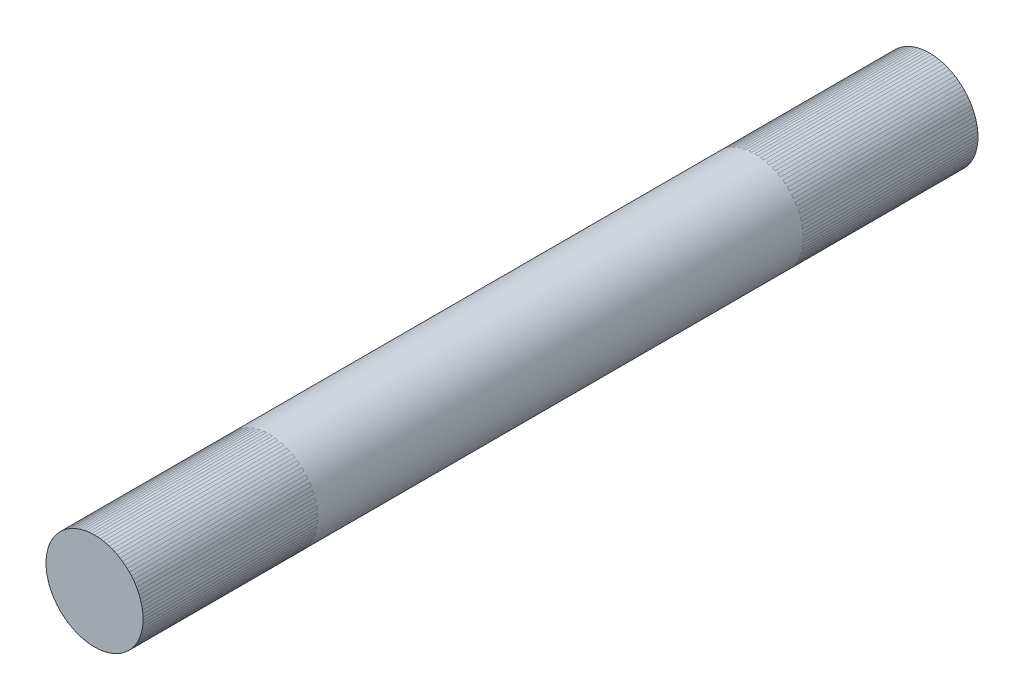
ISO-10303-21;
HEADER;
FILE_DESCRIPTION(('STEP AP214'),'2;1');
FILE_NAME('part.step','',(''),(''),'','','');
FILE_SCHEMA(('AUTOMOTIVE_DESIGN { 1 0 10303 214 1 1 1 1 }'));
ENDSEC;
DATA;
#1=APPLICATION_CONTEXT('core data for automotive mechanical design processes');
#2=APPLICATION_PROTOCOL_DEFINITION('international standard','automotive_design',2000,#1);
#3=PRODUCT_CONTEXT('',#1,'mechanical');
#4=PRODUCT('Part','Part','',(#3));
#5=PRODUCT_RELATED_PRODUCT_CATEGORY('part','',(#4));
#6=PRODUCT_DEFINITION_FORMATION('','',#4);
#7=PRODUCT_DEFINITION_CONTEXT('part definition',#1,'design');
#8=PRODUCT_DEFINITION('design','',#6,#7);
#9=PRODUCT_DEFINITION_SHAPE('','',#8);
#10=(LENGTH_UNIT() NAMED_UNIT(*) SI_UNIT(.MILLI.,.METRE.));
#11=(NAMED_UNIT(*) PLANE_ANGLE_UNIT() SI_UNIT($,.RADIAN.));
#12=(NAMED_UNIT(*) SI_UNIT($,.STERADIAN.) SOLID_ANGLE_UNIT());
#13=UNCERTAINTY_MEASURE_WITH_UNIT(LENGTH_MEASURE(1.E-05),#10,'distance_accuracy_value','');
#14=(GEOMETRIC_REPRESENTATION_CONTEXT(3) GLOBAL_UNCERTAINTY_ASSIGNED_CONTEXT((#13)) GLOBAL_UNIT_ASSIGNED_CONTEXT((#10,
#11,#12)) REPRESENTATION_CONTEXT('',''));
#15=CARTESIAN_POINT('',(0.,0.,0.));
#16=DIRECTION('',(0.,0.,1.));
#17=DIRECTION('',(1.,0.,0.));
#18=AXIS2_PLACEMENT_3D('',#15,#16,#17);
#19=CARTESIAN_POINT('',(0.,0.,-38.0265122421384));
#20=DIRECTION('',(0.,0.,1.));
#21=DIRECTION('',(1.,0.,0.));
#22=AXIS2_PLACEMENT_3D('',#19,#20,#21);
#23=CYLINDRICAL_SURFACE('',#22,6.35);
#24=CARTESIAN_POINT('',(0.,0.,-20.066));
#25=DIRECTION('',(0.,0.,1.));
#26=DIRECTION('',(1.,0.,0.));
#27=AXIS2_PLACEMENT_3D('',#24,#25,#26);
#28=CIRCLE('',#27,6.35);
#29=CARTESIAN_POINT('',(6.34999999999996,0.,-20.066));
#30=VERTEX_POINT('',#29);
#31=EDGE_CURVE('E11',#30,#30,#28,.F.);
#32=ORIENTED_EDGE('',*,*,#31,.F.);
#33=EDGE_LOOP('',(#32));
#34=FACE_BOUND('',#33,.T.);
#35=CARTESIAN_POINT('',(0.,0.,89.1571441105302));
#36=DIRECTION('',(0.,0.,1.));
#37=DIRECTION('',(1.,0.,0.));
#38=AXIS2_PLACEMENT_3D('',#35,#36,#37);
#39=CIRCLE('',#38,6.35);
#40=CARTESIAN_POINT('',(6.34999999999996,0.,89.1571441105302));
#41=VERTEX_POINT('',#40);
#42=EDGE_CURVE('E50',#41,#41,#39,.T.);
#43=ORIENTED_EDGE('',*,*,#42,.F.);
#44=EDGE_LOOP('',(#43));
#45=FACE_BOUND('',#44,.T.);
#46=ADVANCED_FACE('F44',(#34,#45),#23,.T.);
#47=CARTESIAN_POINT('',(0.,0.,89.1571441105302));
#48=DIRECTION('',(0.,0.,1.));
#49=DIRECTION('',(1.,0.,0.));
#50=AXIS2_PLACEMENT_3D('',#47,#48,#49);
#51=PLANE('',#50);
#52=ORIENTED_EDGE('',*,*,#42,.T.);
#53=EDGE_LOOP('',(#52));
#54=FACE_BOUND('',#53,.T.);
#55=ADVANCED_FACE('F56',(#54),#51,.T.);
#56=CARTESIAN_POINT('',(0.,0.,-20.066));
#57=DIRECTION('',(0.,0.,1.));
#58=DIRECTION('',(1.,0.,0.));
#59=AXIS2_PLACEMENT_3D('',#56,#57,#58);
#60=PLANE('',#59);
#61=ORIENTED_EDGE('',*,*,#31,.T.);
#62=EDGE_LOOP('',(#61));
#63=FACE_BOUND('',#62,.T.);
#64=ADVANCED_FACE('F63',(#63),#60,.F.);
#65=CLOSED_SHELL('',(#46,#55,#64));
#66=MANIFOLD_SOLID_BREP('B2',#65);
#67=CARTESIAN_POINT('',(0.,0.,77.7271441105302));
#68=DIRECTION('',(0.,0.,1.));
#69=DIRECTION('',(-1.,0.,0.));
#70=AXIS2_PLACEMENT_3D('',#67,#68,#69);
#71=CYLINDRICAL_SURFACE('',#70,6.35);
#72=CARTESIAN_POINT('',(0.,0.,66.2971441105302));
#73=DIRECTION('',(0.,0.,1.));
#74=DIRECTION('',(-1.,0.,0.));
#75=AXIS2_PLACEMENT_3D('',#72,#73,#74);
#76=CIRCLE('',#75,6.35);
#77=CARTESIAN_POINT('',(-6.35000000000003,0.,66.2971441105302));
#78=VERTEX_POINT('',#77);
#79=EDGE_CURVE('E96',#78,#78,#76,.T.);
#80=ORIENTED_EDGE('',*,*,#79,.F.);
#81=EDGE_LOOP('',(#80));
#82=FACE_BOUND('',#81,.T.);
#83=CARTESIAN_POINT('',(0.,0.,89.1571441105302));
#84=DIRECTION('',(0.,0.,1.));
#85=DIRECTION('',(-1.,0.,0.));
#86=AXIS2_PLACEMENT_3D('',#83,#84,#85);
#87=CIRCLE('',#86,6.35);
#88=CARTESIAN_POINT('',(-6.35000000000004,0.,89.1571441105302));
#89=VERTEX_POINT('',#88);
#90=EDGE_CURVE('E43',#89,#89,#87,.F.);
#91=ORIENTED_EDGE('',*,*,#90,.F.);
#92=EDGE_LOOP('',(#91));
#93=FACE_BOUND('',#92,.T.);
#94=ADVANCED_FACE('F92',(#82,#93),#71,.F.);
#95=OPEN_SHELL('',(#94));
#96=SHELL_BASED_SURFACE_MODEL('B6',(#95));
#97=CARTESIAN_POINT('',(0.,0.,-8.63600000000002));
#98=DIRECTION('',(0.,0.,-1.));
#99=DIRECTION('',(-1.,0.,0.));
#100=AXIS2_PLACEMENT_3D('',#97,#98,#99);
#101=CYLINDRICAL_SURFACE('',#100,6.35);
#102=CARTESIAN_POINT('',(0.,0.,-20.066));
#103=DIRECTION('',(0.,0.,-1.));
#104=DIRECTION('',(-1.,0.,0.));
#105=AXIS2_PLACEMENT_3D('',#102,#103,#104);
#106=CIRCLE('',#105,6.35);
#107=CARTESIAN_POINT('',(-6.35,0.,-20.066));
#108=VERTEX_POINT('',#107);
#109=EDGE_CURVE('E133',#108,#108,#106,.T.);
#110=ORIENTED_EDGE('',*,*,#109,.T.);
#111=EDGE_LOOP('',(#110));
#112=FACE_BOUND('',#111,.T.);
#113=CARTESIAN_POINT('',(0.,0.,2.79399999999998));
#114=DIRECTION('',(0.,0.,-1.));
#115=DIRECTION('',(-1.,0.,0.));
#116=AXIS2_PLACEMENT_3D('',#113,#114,#115);
#117=CIRCLE('',#116,6.35);
#118=CARTESIAN_POINT('',(-6.35000000000001,0.,2.79399999999998));
#119=VERTEX_POINT('',#118);
#120=EDGE_CURVE('E91',#119,#119,#117,.T.);
#121=ORIENTED_EDGE('',*,*,#120,.F.);
#122=EDGE_LOOP('',(#121));
#123=FACE_BOUND('',#122,.T.);
#124=ADVANCED_FACE('F129',(#112,#123),#101,.F.);
#125=OPEN_SHELL('',(#124));
#126=SHELL_BASED_SURFACE_MODEL('B38',(#125));
#127=ADVANCED_BREP_SHAPE_REPRESENTATION('',(#18,#66),#14);
#128=MANIFOLD_SURFACE_SHAPE_REPRESENTATION('',(#18,#96,#126),#14);
#129=SHAPE_REPRESENTATION('',(#18),#14);
#130=SHAPE_DEFINITION_REPRESENTATION(#9,#129);
#131=SHAPE_REPRESENTATION_RELATIONSHIP('','',#129,#127);
#132=SHAPE_REPRESENTATION_RELATIONSHIP('','',#129,#128);
ENDSEC;
END-ISO-10303-21;
